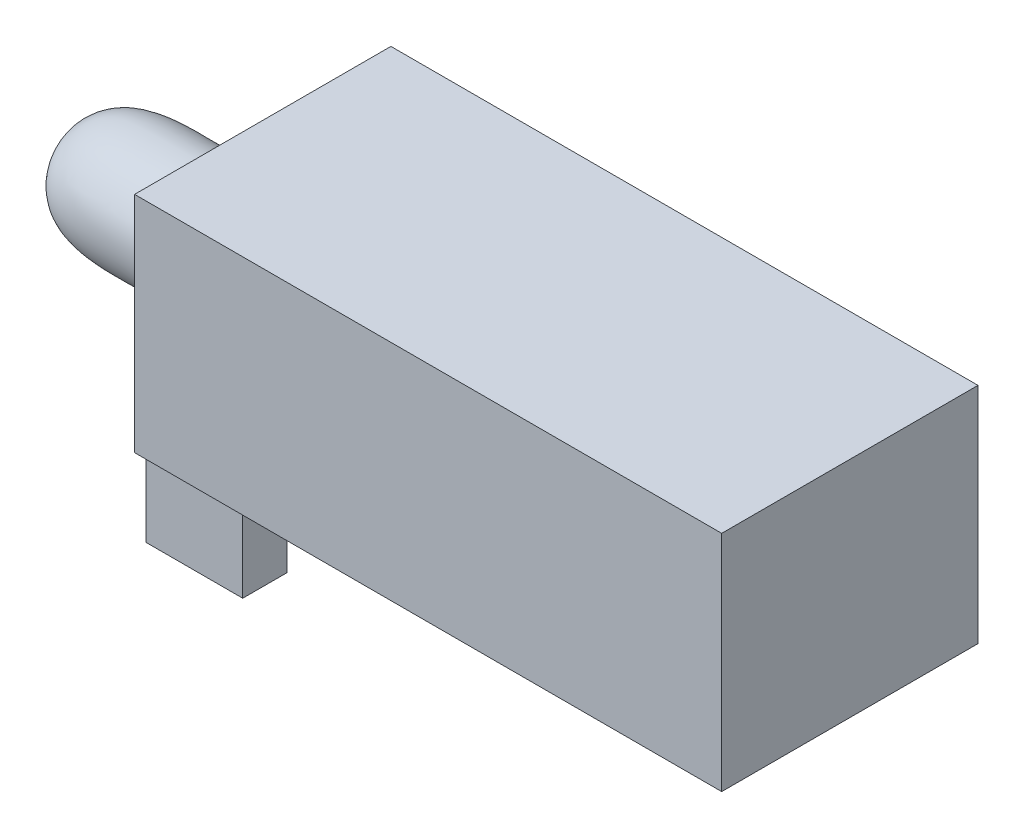
ISO-10303-21;
HEADER;
FILE_DESCRIPTION(('STEP AP214'),'2;1');
FILE_NAME('part.step','',(''),(''),'','','');
FILE_SCHEMA(('AUTOMOTIVE_DESIGN { 1 0 10303 214 1 1 1 1 }'));
ENDSEC;
DATA;
#1=APPLICATION_CONTEXT('core data for automotive mechanical design processes');
#2=APPLICATION_PROTOCOL_DEFINITION('international standard','automotive_design',2000,#1);
#3=PRODUCT_CONTEXT('',#1,'mechanical');
#4=PRODUCT('Part','Part','',(#3));
#5=PRODUCT_RELATED_PRODUCT_CATEGORY('part','',(#4));
#6=PRODUCT_DEFINITION_FORMATION('','',#4);
#7=PRODUCT_DEFINITION_CONTEXT('part definition',#1,'design');
#8=PRODUCT_DEFINITION('design','',#6,#7);
#9=PRODUCT_DEFINITION_SHAPE('','',#8);
#10=(LENGTH_UNIT() NAMED_UNIT(*) SI_UNIT(.MILLI.,.METRE.));
#11=(NAMED_UNIT(*) PLANE_ANGLE_UNIT() SI_UNIT($,.RADIAN.));
#12=(NAMED_UNIT(*) SI_UNIT($,.STERADIAN.) SOLID_ANGLE_UNIT());
#13=UNCERTAINTY_MEASURE_WITH_UNIT(LENGTH_MEASURE(1.E-05),#10,'distance_accuracy_value','');
#14=(GEOMETRIC_REPRESENTATION_CONTEXT(3) GLOBAL_UNCERTAINTY_ASSIGNED_CONTEXT((#13)) GLOBAL_UNIT_ASSIGNED_CONTEXT((#10,
#11,#12)) REPRESENTATION_CONTEXT('',''));
#15=CARTESIAN_POINT('',(0.,0.,0.));
#16=DIRECTION('',(0.,0.,1.));
#17=DIRECTION('',(1.,0.,0.));
#18=AXIS2_PLACEMENT_3D('',#15,#16,#17);
#19=CARTESIAN_POINT('',(-6.618,2.13460817191661,0.));
#20=DIRECTION('',(1.,0.,0.));
#21=DIRECTION('',(0.,0.,-1.));
#22=AXIS2_PLACEMENT_3D('',#19,#20,#21);
#23=CYLINDRICAL_SURFACE('',#22,2.);
#24=CARTESIAN_POINT('',(-6.5,2.13460817191661,0.));
#25=DIRECTION('',(-1.,0.,0.));
#26=DIRECTION('',(0.,0.,1.));
#27=AXIS2_PLACEMENT_3D('',#24,#25,#26);
#28=CIRCLE('',#27,2.);
#29=CARTESIAN_POINT('',(-6.5,3.54881547859821,1.41421981803692));
#30=VERTEX_POINT('',#29);
#31=CARTESIAN_POINT('',(-6.5,0.72040086523501,1.41421981803692));
#32=VERTEX_POINT('',#31);
#33=EDGE_CURVE('E90',#30,#32,#28,.T.);
#34=ORIENTED_EDGE('',*,*,#33,.T.);
#35=DIRECTION('',(1.,0.,0.));
#36=VECTOR('',#35,1.);
#37=CARTESIAN_POINT('',(-6.618,0.72040086523501,1.41421981803692));
#38=LINE('',#37,#36);
#39=CARTESIAN_POINT('',(-6.618,0.72040086523501,1.41421981803692));
#40=VERTEX_POINT('',#39);
#41=EDGE_CURVE('E51',#40,#32,#38,.T.);
#42=ORIENTED_EDGE('',*,*,#41,.F.);
#43=CARTESIAN_POINT('',(-6.618,2.13460817191661,0.));
#44=DIRECTION('',(-1.,0.,0.));
#45=DIRECTION('',(0.,0.,1.));
#46=AXIS2_PLACEMENT_3D('',#43,#44,#45);
#47=CIRCLE('',#46,2.);
#48=CARTESIAN_POINT('',(-6.618,3.54881547859821,1.41421981803692));
#49=VERTEX_POINT('',#48);
#50=EDGE_CURVE('E84',#49,#40,#47,.T.);
#51=ORIENTED_EDGE('',*,*,#50,.F.);
#52=DIRECTION('',(1.,0.,0.));
#53=VECTOR('',#52,1.);
#54=CARTESIAN_POINT('',(-6.618,3.54881547859821,1.41421981803692));
#55=LINE('',#54,#53);
#56=EDGE_CURVE('E92',#49,#30,#55,.T.);
#57=ORIENTED_EDGE('',*,*,#56,.T.);
#58=EDGE_LOOP('',(#34,#42,#51,#57));
#59=FACE_BOUND('',#58,.T.);
#60=ADVANCED_FACE('F43',(#59),#23,.T.);
#61=CARTESIAN_POINT('',(-6.618,3.54881547859821,1.41421981803692));
#62=DIRECTION('',(0.,0.,-1.));
#63=DIRECTION('',(-1.,0.,0.));
#64=AXIS2_PLACEMENT_3D('',#61,#62,#63);
#65=PLANE('',#64);
#66=DIRECTION('',(0.,1.,0.));
#67=VECTOR('',#66,1.);
#68=CARTESIAN_POINT('',(-6.5,3.54881547859821,1.41421981803692));
#69=LINE('',#68,#67);
#70=EDGE_CURVE('E68',#32,#30,#69,.T.);
#71=ORIENTED_EDGE('',*,*,#70,.T.);
#72=ORIENTED_EDGE('',*,*,#56,.F.);
#73=DIRECTION('',(0.,1.,0.));
#74=VECTOR('',#73,1.);
#75=CARTESIAN_POINT('',(-6.618,3.54881547859821,1.41421981803692));
#76=LINE('',#75,#74);
#77=EDGE_CURVE('E58',#40,#49,#76,.T.);
#78=ORIENTED_EDGE('',*,*,#77,.F.);
#79=ORIENTED_EDGE('',*,*,#41,.T.);
#80=EDGE_LOOP('',(#71,#72,#78,#79));
#81=FACE_BOUND('',#80,.T.);
#82=ADVANCED_FACE('F81',(#81),#65,.F.);
#83=CARTESIAN_POINT('',(-6.618,2.13460817191661,0.));
#84=DIRECTION('',(-1.,0.,0.));
#85=DIRECTION('',(0.,0.,1.));
#86=AXIS2_PLACEMENT_3D('',#83,#84,#85);
#87=PLANE('',#86);
#88=CARTESIAN_POINT('',(-6.618,2.13460817191661,0.));
#89=DIRECTION('',(1.,0.,0.));
#90=DIRECTION('',(0.,0.,-1.));
#91=AXIS2_PLACEMENT_3D('',#88,#89,#90);
#92=CIRCLE('',#91,1.4142073066816);
#93=CARTESIAN_POINT('',(-6.618,2.13460817191661,-1.4142073066816));
#94=VERTEX_POINT('',#93);
#95=EDGE_CURVE('E12',#94,#94,#92,.F.);
#96=ORIENTED_EDGE('',*,*,#95,.F.);
#97=EDGE_LOOP('',(#96));
#98=FACE_BOUND('',#97,.T.);
#99=ORIENTED_EDGE('',*,*,#50,.T.);
#100=ORIENTED_EDGE('',*,*,#77,.T.);
#101=EDGE_LOOP('',(#99,#100));
#102=FACE_BOUND('',#101,.T.);
#103=ADVANCED_FACE('F79',(#98,#102),#87,.T.);
#104=CARTESIAN_POINT('',(-6.5,2.13460817191661,0.));
#105=DIRECTION('',(-1.,0.,0.));
#106=DIRECTION('',(0.,0.,1.));
#107=AXIS2_PLACEMENT_3D('',#104,#105,#106);
#108=PLANE('',#107);
#109=ORIENTED_EDGE('',*,*,#33,.F.);
#110=ORIENTED_EDGE('',*,*,#70,.F.);
#111=EDGE_LOOP('',(#109,#110));
#112=FACE_BOUND('',#111,.T.);
#113=ADVANCED_FACE('F75',(#112),#108,.F.);
#114=CARTESIAN_POINT('',(-6.618,3.54881547859821,0.));
#115=CARTESIAN_POINT('',(-7.03347338929885,3.4698744233545,0.));
#116=CARTESIAN_POINT('',(-8.50196330563108,3.28867884207809,0.));
#117=CARTESIAN_POINT('',(-10.4782652977722,3.63958937813257,0.));
#118=CARTESIAN_POINT('',(-10.618,2.13460817191661,0.));
#119=B_SPLINE_CURVE_WITH_KNOTS('',3,(#114,#115,#116,#117,#118),.UNSPECIFIED.,.F.,.F.,(4,1,4),
(0.,0.272311220769774,1.),.UNSPECIFIED.);
#120=CARTESIAN_POINT('',(-6.618,2.13460817191661,0.));
#121=DIRECTION('',(1.,0.,0.));
#122=AXIS1_PLACEMENT('',#120,#121);
#123=SURFACE_OF_REVOLUTION('',#119,#122);
#124=CARTESIAN_POINT('',(-10.618,2.13460817191661,0.));
#125=VERTEX_POINT('',#124);
#126=VERTEX_LOOP('',#125);
#127=FACE_BOUND('',#126,.T.);
#128=ORIENTED_EDGE('',*,*,#95,.T.);
#129=EDGE_LOOP('',(#128));
#130=FACE_BOUND('',#129,.T.);
#131=ADVANCED_FACE('F72',(#127,#130),#123,.F.);
#132=CLOSED_SHELL('',(#60,#82,#103,#113,#131));
#133=MANIFOLD_SOLID_BREP('B2',#132);
#134=CARTESIAN_POINT('',(0.,0.,0.));
#135=DIRECTION('',(0.,1.,0.));
#136=DIRECTION('',(0.,0.,1.));
#137=AXIS2_PLACEMENT_3D('',#134,#135,#136);
#138=PLANE('',#137);
#139=DIRECTION('',(0.,0.,1.));
#140=VECTOR('',#139,1.);
#141=CARTESIAN_POINT('',(-4.2918,0.,2.544));
#142=LINE('',#141,#140);
#143=CARTESIAN_POINT('',(-4.2918,0.,-2.544));
#144=VERTEX_POINT('',#143);
#145=CARTESIAN_POINT('',(-4.2918,0.,2.544));
#146=VERTEX_POINT('',#145);
#147=EDGE_CURVE('E269',#144,#146,#142,.T.);
#148=ORIENTED_EDGE('',*,*,#147,.F.);
#149=DIRECTION('',(1.,0.,0.));
#150=VECTOR('',#149,1.);
#151=CARTESIAN_POINT('',(-6.4,0.,-2.544));
#152=LINE('',#151,#150);
#153=CARTESIAN_POINT('',(-6.4,0.,-2.544));
#154=VERTEX_POINT('',#153);
#155=EDGE_CURVE('E240',#154,#144,#152,.T.);
#156=ORIENTED_EDGE('',*,*,#155,.F.);
#157=DIRECTION('',(0.,0.,1.));
#158=VECTOR('',#157,1.);
#159=CARTESIAN_POINT('',(-6.4,0.,2.794));
#160=LINE('',#159,#158);
#161=CARTESIAN_POINT('',(-6.4,0.,-2.794));
#162=VERTEX_POINT('',#161);
#163=EDGE_CURVE('E258',#162,#154,#160,.T.);
#164=ORIENTED_EDGE('',*,*,#163,.F.);
#165=DIRECTION('',(-1.,0.,0.));
#166=VECTOR('',#165,1.);
#167=CARTESIAN_POINT('',(6.4,0.,-2.794));
#168=LINE('',#167,#166);
#169=CARTESIAN_POINT('',(6.4,0.,-2.794));
#170=VERTEX_POINT('',#169);
#171=EDGE_CURVE('E280',#170,#162,#168,.T.);
#172=ORIENTED_EDGE('',*,*,#171,.F.);
#173=DIRECTION('',(0.,0.,-1.));
#174=VECTOR('',#173,1.);
#175=CARTESIAN_POINT('',(6.4,0.,2.794));
#176=LINE('',#175,#174);
#177=CARTESIAN_POINT('',(6.4,0.,2.794));
#178=VERTEX_POINT('',#177);
#179=EDGE_CURVE('E300',#178,#170,#176,.T.);
#180=ORIENTED_EDGE('',*,*,#179,.F.);
#181=DIRECTION('',(1.,0.,0.));
#182=VECTOR('',#181,1.);
#183=CARTESIAN_POINT('',(6.4,0.,2.794));
#184=LINE('',#183,#182);
#185=CARTESIAN_POINT('',(-6.4,0.,2.794));
#186=VERTEX_POINT('',#185);
#187=EDGE_CURVE('E288',#186,#178,#184,.T.);
#188=ORIENTED_EDGE('',*,*,#187,.F.);
#189=CARTESIAN_POINT('',(-6.4,0.,2.544));
#190=VERTEX_POINT('',#189);
#191=EDGE_CURVE('E255',#190,#186,#160,.T.);
#192=ORIENTED_EDGE('',*,*,#191,.F.);
#193=DIRECTION('',(-1.,0.,0.));
#194=VECTOR('',#193,1.);
#195=CARTESIAN_POINT('',(-6.4,0.,2.544));
#196=LINE('',#195,#194);
#197=EDGE_CURVE('E266',#146,#190,#196,.T.);
#198=ORIENTED_EDGE('',*,*,#197,.F.);
#199=EDGE_LOOP('',(#148,#156,#164,#172,#180,#188,#192,#198));
#200=FACE_BOUND('',#199,.T.);
#201=ADVANCED_FACE('F141',(#200),#138,.F.);
#202=CARTESIAN_POINT('',(-6.4,4.8768,2.794));
#203=DIRECTION('',(1.,0.,0.));
#204=DIRECTION('',(0.,0.,-1.));
#205=AXIS2_PLACEMENT_3D('',#202,#203,#204);
#206=PLANE('',#205);
#207=DIRECTION('',(0.,1.,0.));
#208=VECTOR('',#207,1.);
#209=CARTESIAN_POINT('',(-6.4,-1.82,-1.584));
#210=LINE('',#209,#208);
#211=CARTESIAN_POINT('',(-6.4,-1.82,-1.584));
#212=VERTEX_POINT('',#211);
#213=CARTESIAN_POINT('',(-6.4,-0.2,-1.584));
#214=VERTEX_POINT('',#213);
#215=EDGE_CURVE('E250',#212,#214,#210,.T.);
#216=ORIENTED_EDGE('',*,*,#215,.T.);
#217=DIRECTION('',(0.,0.,-1.));
#218=VECTOR('',#217,1.);
#219=CARTESIAN_POINT('',(-6.4,-0.2,2.544));
#220=LINE('',#219,#218);
#221=CARTESIAN_POINT('',(-6.4,-0.2,1.584));
#222=VERTEX_POINT('',#221);
#223=EDGE_CURVE('E158',#222,#214,#220,.T.);
#224=ORIENTED_EDGE('',*,*,#223,.F.);
#225=DIRECTION('',(0.,1.,0.));
#226=VECTOR('',#225,1.);
#227=CARTESIAN_POINT('',(-6.4,-1.82,1.584));
#228=LINE('',#227,#226);
#229=CARTESIAN_POINT('',(-6.4,-1.82,1.584));
#230=VERTEX_POINT('',#229);
#231=EDGE_CURVE('E247',#230,#222,#228,.T.);
#232=ORIENTED_EDGE('',*,*,#231,.F.);
#233=DIRECTION('',(0.,0.,-1.));
#234=VECTOR('',#233,1.);
#235=CARTESIAN_POINT('',(-6.4,-1.82,2.544));
#236=LINE('',#235,#234);
#237=CARTESIAN_POINT('',(-6.4,-1.82,2.544));
#238=VERTEX_POINT('',#237);
#239=EDGE_CURVE('E268',#238,#230,#236,.T.);
#240=ORIENTED_EDGE('',*,*,#239,.F.);
#241=DIRECTION('',(0.,1.,0.));
#242=VECTOR('',#241,1.);
#243=CARTESIAN_POINT('',(-6.4,-1.82,2.544));
#244=LINE('',#243,#242);
#245=EDGE_CURVE('E270',#238,#190,#244,.T.);
#246=ORIENTED_EDGE('',*,*,#245,.T.);
#247=ORIENTED_EDGE('',*,*,#191,.T.);
#248=DIRECTION('',(0.,-1.,0.));
#249=VECTOR('',#248,1.);
#250=CARTESIAN_POINT('',(-6.4,4.8768,2.794));
#251=LINE('',#250,#249);
#252=CARTESIAN_POINT('',(-6.4,4.8768,2.794));
#253=VERTEX_POINT('',#252);
#254=EDGE_CURVE('E41',#253,#186,#251,.T.);
#255=ORIENTED_EDGE('',*,*,#254,.F.);
#256=DIRECTION('',(0.,0.,1.));
#257=VECTOR('',#256,1.);
#258=CARTESIAN_POINT('',(-6.4,4.8768,2.794));
#259=LINE('',#258,#257);
#260=CARTESIAN_POINT('',(-6.4,4.8768,-2.794));
#261=VERTEX_POINT('',#260);
#262=EDGE_CURVE('E276',#261,#253,#259,.T.);
#263=ORIENTED_EDGE('',*,*,#262,.F.);
#264=DIRECTION('',(0.,-1.,0.));
#265=VECTOR('',#264,1.);
#266=CARTESIAN_POINT('',(-6.4,4.8768,-2.794));
#267=LINE('',#266,#265);
#268=EDGE_CURVE('E285',#261,#162,#267,.T.);
#269=ORIENTED_EDGE('',*,*,#268,.T.);
#270=ORIENTED_EDGE('',*,*,#163,.T.);
#271=DIRECTION('',(0.,1.,0.));
#272=VECTOR('',#271,1.);
#273=CARTESIAN_POINT('',(-6.4,-1.82,-2.544));
#274=LINE('',#273,#272);
#275=CARTESIAN_POINT('',(-6.4,-1.82,-2.544));
#276=VERTEX_POINT('',#275);
#277=EDGE_CURVE('E447',#276,#154,#274,.T.);
#278=ORIENTED_EDGE('',*,*,#277,.F.);
#279=DIRECTION('',(0.,0.,-1.));
#280=VECTOR('',#279,1.);
#281=CARTESIAN_POINT('',(-6.4,-1.82,-1.584));
#282=LINE('',#281,#280);
#283=EDGE_CURVE('E475',#212,#276,#282,.T.);
#284=ORIENTED_EDGE('',*,*,#283,.F.);
#285=EDGE_LOOP('',(#216,#224,#232,#240,#246,#247,#255,#263,#269,#270,#278,#284));
#286=FACE_BOUND('',#285,.T.);
#287=ADVANCED_FACE('F143',(#286),#206,.F.);
#288=CARTESIAN_POINT('',(6.4,4.8768,2.794));
#289=DIRECTION('',(0.,0.,-1.));
#290=DIRECTION('',(-1.,0.,0.));
#291=AXIS2_PLACEMENT_3D('',#288,#289,#290);
#292=PLANE('',#291);
#293=ORIENTED_EDGE('',*,*,#187,.T.);
#294=DIRECTION('',(0.,-1.,0.));
#295=VECTOR('',#294,1.);
#296=CARTESIAN_POINT('',(6.4,4.8768,2.794));
#297=LINE('',#296,#295);
#298=CARTESIAN_POINT('',(6.4,4.8768,2.794));
#299=VERTEX_POINT('',#298);
#300=EDGE_CURVE('E150',#299,#178,#297,.T.);
#301=ORIENTED_EDGE('',*,*,#300,.F.);
#302=DIRECTION('',(1.,0.,0.));
#303=VECTOR('',#302,1.);
#304=CARTESIAN_POINT('',(6.4,4.8768,2.794));
#305=LINE('',#304,#303);
#306=EDGE_CURVE('E279',#253,#299,#305,.T.);
#307=ORIENTED_EDGE('',*,*,#306,.F.);
#308=ORIENTED_EDGE('',*,*,#254,.T.);
#309=EDGE_LOOP('',(#293,#301,#307,#308));
#310=FACE_BOUND('',#309,.T.);
#311=ADVANCED_FACE('F307',(#310),#292,.F.);
#312=CARTESIAN_POINT('',(6.4,4.8768,2.794));
#313=DIRECTION('',(-1.,0.,0.));
#314=DIRECTION('',(0.,0.,1.));
#315=AXIS2_PLACEMENT_3D('',#312,#313,#314);
#316=PLANE('',#315);
#317=ORIENTED_EDGE('',*,*,#179,.T.);
#318=DIRECTION('',(0.,-1.,0.));
#319=VECTOR('',#318,1.);
#320=CARTESIAN_POINT('',(6.4,4.8768,-2.794));
#321=LINE('',#320,#319);
#322=CARTESIAN_POINT('',(6.4,4.8768,-2.794));
#323=VERTEX_POINT('',#322);
#324=EDGE_CURVE('E295',#323,#170,#321,.T.);
#325=ORIENTED_EDGE('',*,*,#324,.F.);
#326=DIRECTION('',(0.,0.,-1.));
#327=VECTOR('',#326,1.);
#328=CARTESIAN_POINT('',(6.4,4.8768,2.794));
#329=LINE('',#328,#327);
#330=EDGE_CURVE('E282',#299,#323,#329,.T.);
#331=ORIENTED_EDGE('',*,*,#330,.F.);
#332=ORIENTED_EDGE('',*,*,#300,.T.);
#333=EDGE_LOOP('',(#317,#325,#331,#332));
#334=FACE_BOUND('',#333,.T.);
#335=ADVANCED_FACE('F312',(#334),#316,.F.);
#336=CARTESIAN_POINT('',(6.4,4.8768,-2.794));
#337=DIRECTION('',(0.,0.,1.));
#338=DIRECTION('',(1.,0.,0.));
#339=AXIS2_PLACEMENT_3D('',#336,#337,#338);
#340=PLANE('',#339);
#341=ORIENTED_EDGE('',*,*,#171,.T.);
#342=ORIENTED_EDGE('',*,*,#268,.F.);
#343=DIRECTION('',(-1.,0.,0.));
#344=VECTOR('',#343,1.);
#345=CARTESIAN_POINT('',(6.4,4.8768,-2.794));
#346=LINE('',#345,#344);
#347=EDGE_CURVE('E284',#323,#261,#346,.T.);
#348=ORIENTED_EDGE('',*,*,#347,.F.);
#349=ORIENTED_EDGE('',*,*,#324,.T.);
#350=EDGE_LOOP('',(#341,#342,#348,#349));
#351=FACE_BOUND('',#350,.T.);
#352=ADVANCED_FACE('F318',(#351),#340,.F.);
#353=CARTESIAN_POINT('',(0.,4.8768,0.));
#354=DIRECTION('',(0.,1.,0.));
#355=DIRECTION('',(0.,0.,1.));
#356=AXIS2_PLACEMENT_3D('',#353,#354,#355);
#357=PLANE('',#356);
#358=ORIENTED_EDGE('',*,*,#262,.T.);
#359=ORIENTED_EDGE('',*,*,#306,.T.);
#360=ORIENTED_EDGE('',*,*,#330,.T.);
#361=ORIENTED_EDGE('',*,*,#347,.T.);
#362=EDGE_LOOP('',(#358,#359,#360,#361));
#363=FACE_BOUND('',#362,.T.);
#364=ADVANCED_FACE('F323',(#363),#357,.T.);
#365=CARTESIAN_POINT('',(-4.2918,-1.82,1.584));
#366=DIRECTION('',(0.,0.,1.));
#367=DIRECTION('',(1.,0.,0.));
#368=AXIS2_PLACEMENT_3D('',#365,#366,#367);
#369=PLANE('',#368);
#370=ORIENTED_EDGE('',*,*,#231,.T.);
#371=DIRECTION('',(1.,0.,0.));
#372=VECTOR('',#371,1.);
#373=CARTESIAN_POINT('',(-4.2918,-0.2,1.584));
#374=LINE('',#373,#372);
#375=CARTESIAN_POINT('',(-4.2918,-0.2,1.584));
#376=VERTEX_POINT('',#375);
#377=EDGE_CURVE('E232',#222,#376,#374,.T.);
#378=ORIENTED_EDGE('',*,*,#377,.T.);
#379=DIRECTION('',(0.,1.,0.));
#380=VECTOR('',#379,1.);
#381=CARTESIAN_POINT('',(-4.2918,-1.82,1.584));
#382=LINE('',#381,#380);
#383=CARTESIAN_POINT('',(-4.2918,-1.82,1.584));
#384=VERTEX_POINT('',#383);
#385=EDGE_CURVE('E256',#384,#376,#382,.T.);
#386=ORIENTED_EDGE('',*,*,#385,.F.);
#387=DIRECTION('',(1.,0.,0.));
#388=VECTOR('',#387,1.);
#389=CARTESIAN_POINT('',(-4.2918,-1.82,1.584));
#390=LINE('',#389,#388);
#391=EDGE_CURVE('E253',#230,#384,#390,.T.);
#392=ORIENTED_EDGE('',*,*,#391,.F.);
#393=EDGE_LOOP('',(#370,#378,#386,#392));
#394=FACE_BOUND('',#393,.T.);
#395=ADVANCED_FACE('F252',(#394),#369,.F.);
#396=CARTESIAN_POINT('',(-4.2918,-1.82,2.544));
#397=DIRECTION('',(-1.,0.,0.));
#398=DIRECTION('',(0.,0.,1.));
#399=AXIS2_PLACEMENT_3D('',#396,#397,#398);
#400=PLANE('',#399);
#401=ORIENTED_EDGE('',*,*,#385,.T.);
#402=DIRECTION('',(0.,0.,1.));
#403=VECTOR('',#402,1.);
#404=CARTESIAN_POINT('',(-4.2918,-0.2,2.544));
#405=LINE('',#404,#403);
#406=CARTESIAN_POINT('',(-4.2918,-0.2,-1.584));
#407=VERTEX_POINT('',#406);
#408=EDGE_CURVE('E235',#407,#376,#405,.T.);
#409=ORIENTED_EDGE('',*,*,#408,.F.);
#410=DIRECTION('',(0.,1.,0.));
#411=VECTOR('',#410,1.);
#412=CARTESIAN_POINT('',(-4.2918,-1.82,-1.584));
#413=LINE('',#412,#411);
#414=CARTESIAN_POINT('',(-4.2918,-1.82,-1.584));
#415=VERTEX_POINT('',#414);
#416=EDGE_CURVE('E464',#415,#407,#413,.T.);
#417=ORIENTED_EDGE('',*,*,#416,.F.);
#418=DIRECTION('',(0.,0.,1.));
#419=VECTOR('',#418,1.);
#420=CARTESIAN_POINT('',(-4.2918,-1.82,-2.544));
#421=LINE('',#420,#419);
#422=CARTESIAN_POINT('',(-4.2918,-1.82,-2.544));
#423=VERTEX_POINT('',#422);
#424=EDGE_CURVE('E454',#423,#415,#421,.T.);
#425=ORIENTED_EDGE('',*,*,#424,.F.);
#426=DIRECTION('',(0.,1.,0.));
#427=VECTOR('',#426,1.);
#428=CARTESIAN_POINT('',(-4.2918,-1.82,-2.544));
#429=LINE('',#428,#427);
#430=EDGE_CURVE('E450',#423,#144,#429,.T.);
#431=ORIENTED_EDGE('',*,*,#430,.T.);
#432=ORIENTED_EDGE('',*,*,#147,.T.);
#433=DIRECTION('',(0.,1.,0.));
#434=VECTOR('',#433,1.);
#435=CARTESIAN_POINT('',(-4.2918,-1.82,2.544));
#436=LINE('',#435,#434);
#437=CARTESIAN_POINT('',(-4.2918,-1.82,2.544));
#438=VERTEX_POINT('',#437);
#439=EDGE_CURVE('E166',#438,#146,#436,.T.);
#440=ORIENTED_EDGE('',*,*,#439,.F.);
#441=DIRECTION('',(0.,0.,1.));
#442=VECTOR('',#441,1.);
#443=CARTESIAN_POINT('',(-4.2918,-1.82,2.544));
#444=LINE('',#443,#442);
#445=EDGE_CURVE('E469',#384,#438,#444,.T.);
#446=ORIENTED_EDGE('',*,*,#445,.F.);
#447=EDGE_LOOP('',(#401,#409,#417,#425,#431,#432,#440,#446));
#448=FACE_BOUND('',#447,.T.);
#449=ADVANCED_FACE('F330',(#448),#400,.F.);
#450=CARTESIAN_POINT('',(-6.4,-1.82,2.544));
#451=DIRECTION('',(0.,0.,-1.));
#452=DIRECTION('',(-1.,0.,0.));
#453=AXIS2_PLACEMENT_3D('',#450,#451,#452);
#454=PLANE('',#453);
#455=ORIENTED_EDGE('',*,*,#439,.T.);
#456=ORIENTED_EDGE('',*,*,#197,.T.);
#457=ORIENTED_EDGE('',*,*,#245,.F.);
#458=DIRECTION('',(-1.,0.,0.));
#459=VECTOR('',#458,1.);
#460=CARTESIAN_POINT('',(-6.4,-1.82,2.544));
#461=LINE('',#460,#459);
#462=EDGE_CURVE('E470',#438,#238,#461,.T.);
#463=ORIENTED_EDGE('',*,*,#462,.F.);
#464=EDGE_LOOP('',(#455,#456,#457,#463));
#465=FACE_BOUND('',#464,.T.);
#466=ADVANCED_FACE('F369',(#465),#454,.F.);
#467=CARTESIAN_POINT('',(0.,-1.82,0.));
#468=DIRECTION('',(0.,1.,0.));
#469=DIRECTION('',(0.,0.,1.));
#470=AXIS2_PLACEMENT_3D('',#467,#468,#469);
#471=PLANE('',#470);
#472=ORIENTED_EDGE('',*,*,#239,.T.);
#473=ORIENTED_EDGE('',*,*,#391,.T.);
#474=ORIENTED_EDGE('',*,*,#445,.T.);
#475=ORIENTED_EDGE('',*,*,#462,.T.);
#476=EDGE_LOOP('',(#472,#473,#474,#475));
#477=FACE_BOUND('',#476,.T.);
#478=ADVANCED_FACE('F363',(#477),#471,.F.);
#479=CARTESIAN_POINT('',(-4.2918,-1.82,-1.584));
#480=DIRECTION('',(0.,0.,-1.));
#481=DIRECTION('',(-1.,0.,0.));
#482=AXIS2_PLACEMENT_3D('',#479,#480,#481);
#483=PLANE('',#482);
#484=ORIENTED_EDGE('',*,*,#416,.T.);
#485=DIRECTION('',(-1.,0.,0.));
#486=VECTOR('',#485,1.);
#487=CARTESIAN_POINT('',(-4.2918,-0.2,-1.584));
#488=LINE('',#487,#486);
#489=EDGE_CURVE('E241',#407,#214,#488,.T.);
#490=ORIENTED_EDGE('',*,*,#489,.T.);
#491=ORIENTED_EDGE('',*,*,#215,.F.);
#492=DIRECTION('',(-1.,0.,0.));
#493=VECTOR('',#492,1.);
#494=CARTESIAN_POINT('',(-4.2918,-1.82,-1.584));
#495=LINE('',#494,#493);
#496=EDGE_CURVE('E457',#415,#212,#495,.T.);
#497=ORIENTED_EDGE('',*,*,#496,.F.);
#498=EDGE_LOOP('',(#484,#490,#491,#497));
#499=FACE_BOUND('',#498,.T.);
#500=ADVANCED_FACE('F368',(#499),#483,.F.);
#501=CARTESIAN_POINT('',(-6.4,-1.82,-2.544));
#502=DIRECTION('',(0.,0.,1.));
#503=DIRECTION('',(1.,0.,0.));
#504=AXIS2_PLACEMENT_3D('',#501,#502,#503);
#505=PLANE('',#504);
#506=ORIENTED_EDGE('',*,*,#277,.T.);
#507=ORIENTED_EDGE('',*,*,#155,.T.);
#508=ORIENTED_EDGE('',*,*,#430,.F.);
#509=DIRECTION('',(1.,0.,0.));
#510=VECTOR('',#509,1.);
#511=CARTESIAN_POINT('',(-6.4,-1.82,-2.544));
#512=LINE('',#511,#510);
#513=EDGE_CURVE('E449',#276,#423,#512,.T.);
#514=ORIENTED_EDGE('',*,*,#513,.F.);
#515=EDGE_LOOP('',(#506,#507,#508,#514));
#516=FACE_BOUND('',#515,.T.);
#517=ADVANCED_FACE('F383',(#516),#505,.F.);
#518=CARTESIAN_POINT('',(0.,-1.82,0.));
#519=DIRECTION('',(0.,-1.,0.));
#520=DIRECTION('',(0.,0.,-1.));
#521=AXIS2_PLACEMENT_3D('',#518,#519,#520);
#522=PLANE('',#521);
#523=ORIENTED_EDGE('',*,*,#424,.T.);
#524=ORIENTED_EDGE('',*,*,#496,.T.);
#525=ORIENTED_EDGE('',*,*,#283,.T.);
#526=ORIENTED_EDGE('',*,*,#513,.T.);
#527=EDGE_LOOP('',(#523,#524,#525,#526));
#528=FACE_BOUND('',#527,.T.);
#529=ADVANCED_FACE('F379',(#528),#522,.T.);
#530=CARTESIAN_POINT('',(0.,-0.2,0.));
#531=DIRECTION('',(0.,-1.,0.));
#532=DIRECTION('',(0.,0.,-1.));
#533=AXIS2_PLACEMENT_3D('',#530,#531,#532);
#534=PLANE('',#533);
#535=ORIENTED_EDGE('',*,*,#377,.F.);
#536=ORIENTED_EDGE('',*,*,#223,.T.);
#537=ORIENTED_EDGE('',*,*,#489,.F.);
#538=ORIENTED_EDGE('',*,*,#408,.T.);
#539=EDGE_LOOP('',(#535,#536,#537,#538));
#540=FACE_BOUND('',#539,.T.);
#541=ADVANCED_FACE('F233',(#540),#534,.T.);
#542=CLOSED_SHELL('',(#201,#287,#311,#335,#352,#364,#395,#449,#466,#478,#500,#517,#529,#541));
#543=MANIFOLD_SOLID_BREP('B6',#542);
#544=ADVANCED_BREP_SHAPE_REPRESENTATION('',(#18,#133,#543),#14);
#545=SHAPE_DEFINITION_REPRESENTATION(#9,#544);
ENDSEC;
END-ISO-10303-21;
